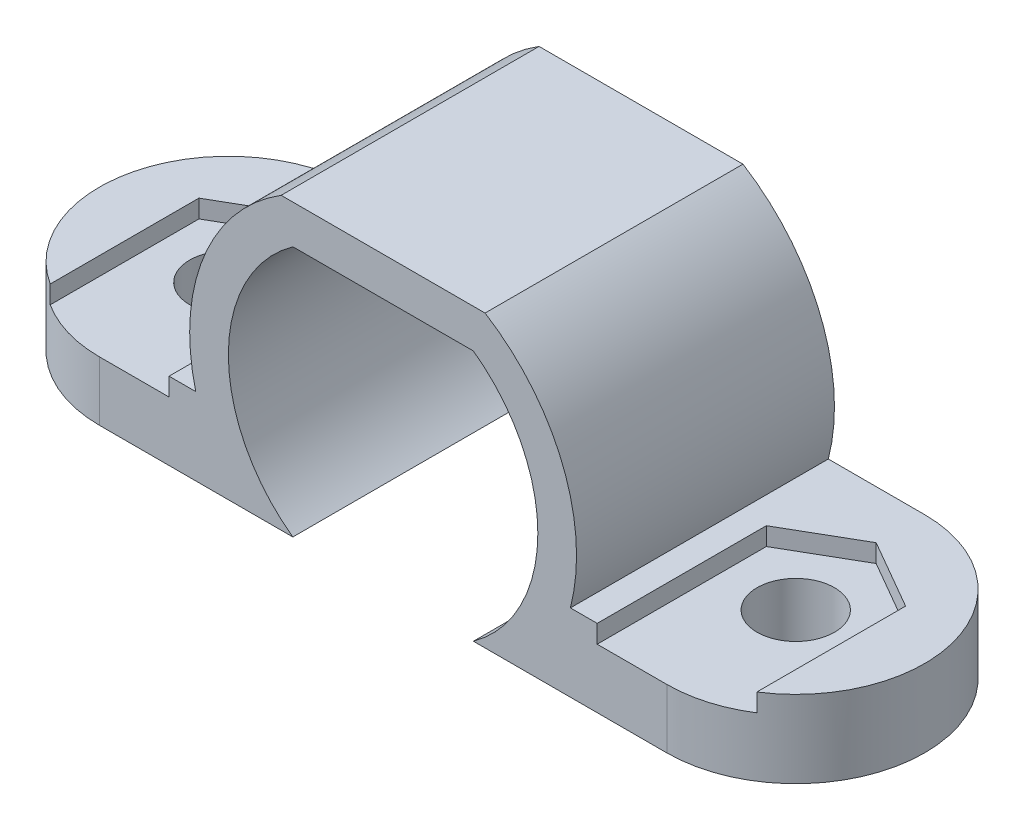
ISO-10303-21;
HEADER;
FILE_DESCRIPTION(('STEP AP214'),'2;1');
FILE_NAME('part.step','',(''),(''),'','','');
FILE_SCHEMA(('AUTOMOTIVE_DESIGN { 1 0 10303 214 1 1 1 1 }'));
ENDSEC;
DATA;
#1=APPLICATION_CONTEXT('core data for automotive mechanical design processes');
#2=APPLICATION_PROTOCOL_DEFINITION('international standard','automotive_design',2000,#1);
#3=PRODUCT_CONTEXT('',#1,'mechanical');
#4=PRODUCT('Part','Part','',(#3));
#5=PRODUCT_RELATED_PRODUCT_CATEGORY('part','',(#4));
#6=PRODUCT_DEFINITION_FORMATION('','',#4);
#7=PRODUCT_DEFINITION_CONTEXT('part definition',#1,'design');
#8=PRODUCT_DEFINITION('design','',#6,#7);
#9=PRODUCT_DEFINITION_SHAPE('','',#8);
#10=(LENGTH_UNIT() NAMED_UNIT(*) SI_UNIT(.MILLI.,.METRE.));
#11=(NAMED_UNIT(*) PLANE_ANGLE_UNIT() SI_UNIT($,.RADIAN.));
#12=(NAMED_UNIT(*) SI_UNIT($,.STERADIAN.) SOLID_ANGLE_UNIT());
#13=UNCERTAINTY_MEASURE_WITH_UNIT(LENGTH_MEASURE(1.E-05),#10,'distance_accuracy_value','');
#14=(GEOMETRIC_REPRESENTATION_CONTEXT(3) GLOBAL_UNCERTAINTY_ASSIGNED_CONTEXT((#13)) GLOBAL_UNIT_ASSIGNED_CONTEXT((#10,
#11,#12)) REPRESENTATION_CONTEXT('',''));
#15=CARTESIAN_POINT('',(0.,0.,0.));
#16=DIRECTION('',(0.,0.,1.));
#17=DIRECTION('',(1.,0.,0.));
#18=AXIS2_PLACEMENT_3D('',#15,#16,#17);
#19=CARTESIAN_POINT('',(7.26225743377546,-1.87339717240448,10.));
#20=DIRECTION('',(0.,-1.,0.));
#21=DIRECTION('',(0.,0.,-1.));
#22=AXIS2_PLACEMENT_3D('',#19,#20,#21);
#23=PLANE('',#22);
#24=DIRECTION('',(-1.,0.,0.));
#25=VECTOR('',#24,1.);
#26=CARTESIAN_POINT('',(7.26225743377546,-1.87339717240448,10.));
#27=LINE('',#26,#25);
#28=CARTESIAN_POINT('',(8.3,-1.87339717240448,10.));
#29=VERTEX_POINT('',#28);
#30=CARTESIAN_POINT('',(7.26225743377546,-1.87339717240448,10.));
#31=VERTEX_POINT('',#30);
#32=EDGE_CURVE('E301',#29,#31,#27,.T.);
#33=ORIENTED_EDGE('',*,*,#32,.F.);
#34=DIRECTION('',(0.,0.,-1.));
#35=VECTOR('',#34,1.);
#36=CARTESIAN_POINT('',(8.3,-1.87339717240448,6.55884572681199));
#37=LINE('',#36,#35);
#38=CARTESIAN_POINT('',(8.3,-1.87339717240448,3.44115427318801));
#39=VERTEX_POINT('',#38);
#40=EDGE_CURVE('E205',#29,#39,#37,.T.);
#41=ORIENTED_EDGE('',*,*,#40,.T.);
#42=DIRECTION('',(0.866025403784438,0.,-0.500000000000001));
#43=VECTOR('',#42,1.);
#44=CARTESIAN_POINT('',(8.3,-1.87339717240448,3.44115427318801));
#45=LINE('',#44,#43);
#46=CARTESIAN_POINT('',(11.,-1.87339717240448,1.88230854637602));
#47=VERTEX_POINT('',#46);
#48=EDGE_CURVE('E229',#39,#47,#45,.T.);
#49=ORIENTED_EDGE('',*,*,#48,.T.);
#50=DIRECTION('',(0.866025403784439,0.,0.499999999999999));
#51=VECTOR('',#50,1.);
#52=CARTESIAN_POINT('',(11.,-1.87339717240448,1.88230854637602));
#53=LINE('',#52,#51);
#54=CARTESIAN_POINT('',(13.7,-1.87339717240448,3.44115427318801));
#55=VERTEX_POINT('',#54);
#56=EDGE_CURVE('E226',#47,#55,#53,.T.);
#57=ORIENTED_EDGE('',*,*,#56,.T.);
#58=DIRECTION('',(0.,0.,1.));
#59=VECTOR('',#58,1.);
#60=CARTESIAN_POINT('',(13.7,-1.87339717240448,3.44115427318801));
#61=LINE('',#60,#59);
#62=CARTESIAN_POINT('',(13.7,-1.87339717240448,9.20832508250017));
#63=VERTEX_POINT('',#62);
#64=EDGE_CURVE('E55',#55,#63,#61,.T.);
#65=ORIENTED_EDGE('',*,*,#64,.T.);
#66=CARTESIAN_POINT('',(11.,-1.87339717240448,5.));
#67=DIRECTION('',(0.,-1.,0.));
#68=DIRECTION('',(0.,0.,-1.));
#69=AXIS2_PLACEMENT_3D('',#66,#67,#68);
#70=CIRCLE('',#69,5.);
#71=CARTESIAN_POINT('',(11.,-1.87339717240448,0.));
#72=VERTEX_POINT('',#71);
#73=EDGE_CURVE('E11',#63,#72,#70,.F.);
#74=ORIENTED_EDGE('',*,*,#73,.T.);
#75=DIRECTION('',(-1.,0.,0.));
#76=VECTOR('',#75,1.);
#77=CARTESIAN_POINT('',(7.26225743377546,-1.87339717240448,0.));
#78=LINE('',#77,#76);
#79=CARTESIAN_POINT('',(7.26225743377546,-1.87339717240448,0.));
#80=VERTEX_POINT('',#79);
#81=EDGE_CURVE('E324',#72,#80,#78,.T.);
#82=ORIENTED_EDGE('',*,*,#81,.T.);
#83=DIRECTION('',(0.,0.,-1.));
#84=VECTOR('',#83,1.);
#85=CARTESIAN_POINT('',(7.26225743377546,-1.87339717240448,10.));
#86=LINE('',#85,#84);
#87=EDGE_CURVE('E334',#31,#80,#86,.T.);
#88=ORIENTED_EDGE('',*,*,#87,.F.);
#89=EDGE_LOOP('',(#33,#41,#49,#57,#65,#74,#82,#88));
#90=FACE_BOUND('',#89,.T.);
#91=ADVANCED_FACE('F37',(#90),#23,.F.);
#92=CARTESIAN_POINT('',(11.,-4.87339717240448,5.));
#93=DIRECTION('',(0.,1.,0.));
#94=DIRECTION('',(0.,0.,1.));
#95=AXIS2_PLACEMENT_3D('',#92,#93,#94);
#96=CYLINDRICAL_SURFACE('',#95,5.);
#97=ORIENTED_EDGE('',*,*,#73,.F.);
#98=DIRECTION('',(0.,1.,0.));
#99=VECTOR('',#98,1.);
#100=CARTESIAN_POINT('',(13.7,-4.87339717240448,9.20832508250017));
#101=LINE('',#100,#99);
#102=CARTESIAN_POINT('',(13.7,-2.57339717240448,9.20832508250017));
#103=VERTEX_POINT('',#102);
#104=EDGE_CURVE('E215',#63,#103,#101,.F.);
#105=ORIENTED_EDGE('',*,*,#104,.T.);
#106=CARTESIAN_POINT('',(11.,-2.57339717240448,5.));
#107=DIRECTION('',(0.,1.,0.));
#108=DIRECTION('',(0.,0.,1.));
#109=AXIS2_PLACEMENT_3D('',#106,#107,#108);
#110=CIRCLE('',#109,5.);
#111=CARTESIAN_POINT('',(11.,-2.57339717240448,10.));
#112=VERTEX_POINT('',#111);
#113=EDGE_CURVE('E213',#103,#112,#110,.F.);
#114=ORIENTED_EDGE('',*,*,#113,.T.);
#115=DIRECTION('',(0.,-1.,0.));
#116=VECTOR('',#115,1.);
#117=CARTESIAN_POINT('',(11.,-4.87339717240448,10.));
#118=LINE('',#117,#116);
#119=CARTESIAN_POINT('',(11.,-4.87339717240448,10.));
#120=VERTEX_POINT('',#119);
#121=EDGE_CURVE('E212',#120,#112,#118,.F.);
#122=ORIENTED_EDGE('',*,*,#121,.F.);
#123=CARTESIAN_POINT('',(11.,-4.87339717240448,5.));
#124=DIRECTION('',(0.,1.,0.));
#125=DIRECTION('',(0.,0.,1.));
#126=AXIS2_PLACEMENT_3D('',#123,#124,#125);
#127=CIRCLE('',#126,5.);
#128=CARTESIAN_POINT('',(11.,-4.87339717240448,0.));
#129=VERTEX_POINT('',#128);
#130=EDGE_CURVE('E47',#129,#120,#127,.F.);
#131=ORIENTED_EDGE('',*,*,#130,.F.);
#132=DIRECTION('',(0.,1.,0.));
#133=VECTOR('',#132,1.);
#134=CARTESIAN_POINT('',(11.,0.,0.));
#135=LINE('',#134,#133);
#136=EDGE_CURVE('E363',#72,#129,#135,.F.);
#137=ORIENTED_EDGE('',*,*,#136,.F.);
#138=EDGE_LOOP('',(#97,#105,#114,#122,#131,#137));
#139=FACE_BOUND('',#138,.T.);
#140=ADVANCED_FACE('F40',(#139),#96,.T.);
#141=CARTESIAN_POINT('',(0.,0.,10.));
#142=DIRECTION('',(0.,0.,1.));
#143=DIRECTION('',(1.,0.,0.));
#144=AXIS2_PLACEMENT_3D('',#141,#142,#143);
#145=PLANE('',#144);
#146=DIRECTION('',(-1.,0.,0.));
#147=VECTOR('',#146,1.);
#148=CARTESIAN_POINT('',(8.3,-2.57339717240448,10.));
#149=LINE('',#148,#147);
#150=CARTESIAN_POINT('',(8.3,-2.57339717240448,10.));
#151=VERTEX_POINT('',#150);
#152=EDGE_CURVE('E193',#112,#151,#149,.T.);
#153=ORIENTED_EDGE('',*,*,#152,.T.);
#154=DIRECTION('',(0.,1.,0.));
#155=VECTOR('',#154,1.);
#156=CARTESIAN_POINT('',(8.3,-1.87339717240448,10.));
#157=LINE('',#156,#155);
#158=EDGE_CURVE('E203',#151,#29,#157,.T.);
#159=ORIENTED_EDGE('',*,*,#158,.T.);
#160=ORIENTED_EDGE('',*,*,#32,.T.);
#161=CARTESIAN_POINT('',(0.,0.,10.));
#162=DIRECTION('',(0.,0.,1.));
#163=DIRECTION('',(1.,0.,0.));
#164=AXIS2_PLACEMENT_3D('',#161,#162,#163);
#165=CIRCLE('',#164,7.5);
#166=CARTESIAN_POINT('',(3.95345525873084,6.37339717240448,10.));
#167=VERTEX_POINT('',#166);
#168=EDGE_CURVE('E303',#31,#167,#165,.T.);
#169=ORIENTED_EDGE('',*,*,#168,.T.);
#170=DIRECTION('',(-1.,0.,0.));
#171=VECTOR('',#170,1.);
#172=CARTESIAN_POINT('',(-3.95345525873084,6.37339717240448,10.));
#173=LINE('',#172,#171);
#174=CARTESIAN_POINT('',(-3.95345525873084,6.37339717240448,10.));
#175=VERTEX_POINT('',#174);
#176=EDGE_CURVE('E305',#167,#175,#173,.T.);
#177=ORIENTED_EDGE('',*,*,#176,.T.);
#178=CARTESIAN_POINT('',(0.,0.,10.));
#179=DIRECTION('',(0.,0.,1.));
#180=DIRECTION('',(1.,0.,0.));
#181=AXIS2_PLACEMENT_3D('',#178,#179,#180);
#182=CIRCLE('',#181,7.5);
#183=CARTESIAN_POINT('',(-7.26225743377546,-1.87339717240448,10.));
#184=VERTEX_POINT('',#183);
#185=EDGE_CURVE('E284',#175,#184,#182,.T.);
#186=ORIENTED_EDGE('',*,*,#185,.T.);
#187=DIRECTION('',(-1.,0.,0.));
#188=VECTOR('',#187,1.);
#189=CARTESIAN_POINT('',(-16.,-1.87339717240448,10.));
#190=LINE('',#189,#188);
#191=CARTESIAN_POINT('',(-8.3,-1.87339717240448,10.));
#192=VERTEX_POINT('',#191);
#193=EDGE_CURVE('E287',#184,#192,#190,.T.);
#194=ORIENTED_EDGE('',*,*,#193,.T.);
#195=DIRECTION('',(0.,1.,0.));
#196=VECTOR('',#195,1.);
#197=CARTESIAN_POINT('',(-8.3,-1.87339717240448,10.));
#198=LINE('',#197,#196);
#199=CARTESIAN_POINT('',(-8.3,-2.57339717240448,10.));
#200=VERTEX_POINT('',#199);
#201=EDGE_CURVE('E238',#200,#192,#198,.T.);
#202=ORIENTED_EDGE('',*,*,#201,.F.);
#203=DIRECTION('',(1.,0.,0.));
#204=VECTOR('',#203,1.);
#205=CARTESIAN_POINT('',(-8.3,-2.57339717240448,10.));
#206=LINE('',#205,#204);
#207=CARTESIAN_POINT('',(-11.,-2.57339717240448,10.));
#208=VERTEX_POINT('',#207);
#209=EDGE_CURVE('E241',#208,#200,#206,.T.);
#210=ORIENTED_EDGE('',*,*,#209,.F.);
#211=DIRECTION('',(0.,1.,0.));
#212=VECTOR('',#211,1.);
#213=CARTESIAN_POINT('',(-11.,-1.87339717240448,10.));
#214=LINE('',#213,#212);
#215=CARTESIAN_POINT('',(-11.,-4.87339717240448,10.));
#216=VERTEX_POINT('',#215);
#217=EDGE_CURVE('E352',#208,#216,#214,.F.);
#218=ORIENTED_EDGE('',*,*,#217,.T.);
#219=DIRECTION('',(1.,0.,0.));
#220=VECTOR('',#219,1.);
#221=CARTESIAN_POINT('',(-16.,-4.87339717240448,10.));
#222=LINE('',#221,#220);
#223=CARTESIAN_POINT('',(-3.5,-4.87339717240448,10.));
#224=VERTEX_POINT('',#223);
#225=EDGE_CURVE('E291',#216,#224,#222,.T.);
#226=ORIENTED_EDGE('',*,*,#225,.T.);
#227=CARTESIAN_POINT('',(0.,0.,10.));
#228=DIRECTION('',(0.,0.,-1.));
#229=DIRECTION('',(1.,0.,0.));
#230=AXIS2_PLACEMENT_3D('',#227,#228,#229);
#231=CIRCLE('',#230,6.);
#232=CARTESIAN_POINT('',(-3.5,4.87339717240448,10.));
#233=VERTEX_POINT('',#232);
#234=EDGE_CURVE('E293',#224,#233,#231,.T.);
#235=ORIENTED_EDGE('',*,*,#234,.T.);
#236=DIRECTION('',(1.,0.,0.));
#237=VECTOR('',#236,1.);
#238=CARTESIAN_POINT('',(-3.5,4.87339717240448,10.));
#239=LINE('',#238,#237);
#240=CARTESIAN_POINT('',(3.5,4.87339717240448,10.));
#241=VERTEX_POINT('',#240);
#242=EDGE_CURVE('E295',#233,#241,#239,.T.);
#243=ORIENTED_EDGE('',*,*,#242,.T.);
#244=CARTESIAN_POINT('',(0.,0.,10.));
#245=DIRECTION('',(0.,0.,-1.));
#246=DIRECTION('',(1.,0.,0.));
#247=AXIS2_PLACEMENT_3D('',#244,#245,#246);
#248=CIRCLE('',#247,6.);
#249=CARTESIAN_POINT('',(3.5,-4.87339717240448,10.));
#250=VERTEX_POINT('',#249);
#251=EDGE_CURVE('E297',#241,#250,#248,.T.);
#252=ORIENTED_EDGE('',*,*,#251,.T.);
#253=DIRECTION('',(1.,0.,0.));
#254=VECTOR('',#253,1.);
#255=CARTESIAN_POINT('',(3.5,-4.87339717240448,10.));
#256=LINE('',#255,#254);
#257=EDGE_CURVE('E299',#250,#120,#256,.T.);
#258=ORIENTED_EDGE('',*,*,#257,.T.);
#259=ORIENTED_EDGE('',*,*,#121,.T.);
#260=EDGE_LOOP('',(#153,#159,#160,#169,#177,#186,#194,#202,#210,#218,#226,#235,#243,#252,#258,#259));
#261=FACE_BOUND('',#260,.T.);
#262=ADVANCED_FACE('F210',(#261),#145,.T.);
#263=CARTESIAN_POINT('',(11.,-4.87339717240448,5.));
#264=DIRECTION('',(0.,1.,0.));
#265=DIRECTION('',(0.,0.,1.));
#266=AXIS2_PLACEMENT_3D('',#263,#264,#265);
#267=CYLINDRICAL_SURFACE('',#266,1.5);
#268=CARTESIAN_POINT('',(11.,-4.87339717240448,5.));
#269=DIRECTION('',(0.,1.,0.));
#270=DIRECTION('',(0.,0.,1.));
#271=AXIS2_PLACEMENT_3D('',#268,#269,#270);
#272=CIRCLE('',#271,1.5);
#273=CARTESIAN_POINT('',(11.,-4.87339717240448,6.5));
#274=VERTEX_POINT('',#273);
#275=EDGE_CURVE('E277',#274,#274,#272,.T.);
#276=ORIENTED_EDGE('',*,*,#275,.F.);
#277=EDGE_LOOP('',(#276));
#278=FACE_BOUND('',#277,.T.);
#279=CARTESIAN_POINT('',(11.,-2.57339717240448,5.));
#280=DIRECTION('',(0.,1.,0.));
#281=DIRECTION('',(0.,0.,1.));
#282=AXIS2_PLACEMENT_3D('',#279,#280,#281);
#283=CIRCLE('',#282,1.5);
#284=CARTESIAN_POINT('',(11.,-2.57339717240448,6.5));
#285=VERTEX_POINT('',#284);
#286=EDGE_CURVE('E42',#285,#285,#283,.F.);
#287=ORIENTED_EDGE('',*,*,#286,.F.);
#288=EDGE_LOOP('',(#287));
#289=FACE_BOUND('',#288,.T.);
#290=ADVANCED_FACE('F374',(#278,#289),#267,.F.);
#291=CARTESIAN_POINT('',(-11.,-4.87339717240448,5.));
#292=DIRECTION('',(0.,1.,0.));
#293=DIRECTION('',(0.,0.,1.));
#294=AXIS2_PLACEMENT_3D('',#291,#292,#293);
#295=CYLINDRICAL_SURFACE('',#294,1.5);
#296=CARTESIAN_POINT('',(-11.,-4.87339717240448,5.));
#297=DIRECTION('',(0.,1.,0.));
#298=DIRECTION('',(0.,0.,1.));
#299=AXIS2_PLACEMENT_3D('',#296,#297,#298);
#300=CIRCLE('',#299,1.5);
#301=CARTESIAN_POINT('',(-11.,-4.87339717240448,6.5));
#302=VERTEX_POINT('',#301);
#303=EDGE_CURVE('E280',#302,#302,#300,.T.);
#304=ORIENTED_EDGE('',*,*,#303,.F.);
#305=EDGE_LOOP('',(#304));
#306=FACE_BOUND('',#305,.T.);
#307=CARTESIAN_POINT('',(-11.,-2.57339717240448,5.));
#308=DIRECTION('',(0.,1.,0.));
#309=DIRECTION('',(0.,0.,1.));
#310=AXIS2_PLACEMENT_3D('',#307,#308,#309);
#311=CIRCLE('',#310,1.5);
#312=CARTESIAN_POINT('',(-11.,-2.57339717240448,6.5));
#313=VERTEX_POINT('',#312);
#314=EDGE_CURVE('E272',#313,#313,#311,.F.);
#315=ORIENTED_EDGE('',*,*,#314,.F.);
#316=EDGE_LOOP('',(#315));
#317=FACE_BOUND('',#316,.T.);
#318=ADVANCED_FACE('F371',(#306,#317),#295,.F.);
#319=CARTESIAN_POINT('',(-11.,-1.87339717240448,5.));
#320=DIRECTION('',(0.,-1.,0.));
#321=DIRECTION('',(0.,0.,-1.));
#322=AXIS2_PLACEMENT_3D('',#319,#320,#321);
#323=CYLINDRICAL_SURFACE('',#322,5.);
#324=CARTESIAN_POINT('',(-11.,-2.57339717240448,5.));
#325=DIRECTION('',(0.,-1.,0.));
#326=DIRECTION('',(0.,0.,-1.));
#327=AXIS2_PLACEMENT_3D('',#324,#325,#326);
#328=CIRCLE('',#327,5.);
#329=CARTESIAN_POINT('',(-13.7,-2.57339717240448,9.20832508250017));
#330=VERTEX_POINT('',#329);
#331=EDGE_CURVE('E247',#330,#208,#328,.F.);
#332=ORIENTED_EDGE('',*,*,#331,.F.);
#333=DIRECTION('',(0.,-1.,0.));
#334=VECTOR('',#333,1.);
#335=CARTESIAN_POINT('',(-13.7,-1.87339717240448,9.20832508250017));
#336=LINE('',#335,#334);
#337=CARTESIAN_POINT('',(-13.7,-1.87339717240448,9.20832508250017));
#338=VERTEX_POINT('',#337);
#339=EDGE_CURVE('E244',#338,#330,#336,.T.);
#340=ORIENTED_EDGE('',*,*,#339,.F.);
#341=CARTESIAN_POINT('',(-11.,-1.87339717240448,5.));
#342=DIRECTION('',(0.,-1.,0.));
#343=DIRECTION('',(0.,0.,-1.));
#344=AXIS2_PLACEMENT_3D('',#341,#342,#343);
#345=CIRCLE('',#344,5.);
#346=CARTESIAN_POINT('',(-11.,-1.87339717240448,0.));
#347=VERTEX_POINT('',#346);
#348=EDGE_CURVE('E357',#347,#338,#345,.F.);
#349=ORIENTED_EDGE('',*,*,#348,.F.);
#350=DIRECTION('',(0.,-1.,0.));
#351=VECTOR('',#350,1.);
#352=CARTESIAN_POINT('',(-11.,0.,0.));
#353=LINE('',#352,#351);
#354=CARTESIAN_POINT('',(-11.,-4.87339717240448,0.));
#355=VERTEX_POINT('',#354);
#356=EDGE_CURVE('E354',#355,#347,#353,.F.);
#357=ORIENTED_EDGE('',*,*,#356,.F.);
#358=CARTESIAN_POINT('',(-11.,-4.87339717240448,5.));
#359=DIRECTION('',(0.,1.,0.));
#360=DIRECTION('',(0.,0.,1.));
#361=AXIS2_PLACEMENT_3D('',#358,#359,#360);
#362=CIRCLE('',#361,5.);
#363=EDGE_CURVE('E360',#216,#355,#362,.F.);
#364=ORIENTED_EDGE('',*,*,#363,.F.);
#365=ORIENTED_EDGE('',*,*,#217,.F.);
#366=EDGE_LOOP('',(#332,#340,#349,#357,#364,#365));
#367=FACE_BOUND('',#366,.T.);
#368=ADVANCED_FACE('F373',(#367),#323,.T.);
#369=CARTESIAN_POINT('',(0.,0.,10.));
#370=DIRECTION('',(0.,0.,-1.));
#371=DIRECTION('',(-1.,0.,0.));
#372=AXIS2_PLACEMENT_3D('',#369,#370,#371);
#373=CYLINDRICAL_SURFACE('',#372,7.5);
#374=CARTESIAN_POINT('',(0.,0.,0.));
#375=DIRECTION('',(0.,0.,1.));
#376=DIRECTION('',(1.,0.,0.));
#377=AXIS2_PLACEMENT_3D('',#374,#375,#376);
#378=CIRCLE('',#377,7.5);
#379=CARTESIAN_POINT('',(-3.95345525873084,6.37339717240448,0.));
#380=VERTEX_POINT('',#379);
#381=CARTESIAN_POINT('',(-7.26225743377546,-1.87339717240448,0.));
#382=VERTEX_POINT('',#381);
#383=EDGE_CURVE('E283',#380,#382,#378,.T.);
#384=ORIENTED_EDGE('',*,*,#383,.T.);
#385=DIRECTION('',(0.,0.,-1.));
#386=VECTOR('',#385,1.);
#387=CARTESIAN_POINT('',(-7.26225743377546,-1.87339717240448,10.));
#388=LINE('',#387,#386);
#389=EDGE_CURVE('E349',#184,#382,#388,.T.);
#390=ORIENTED_EDGE('',*,*,#389,.F.);
#391=ORIENTED_EDGE('',*,*,#185,.F.);
#392=DIRECTION('',(0.,0.,-1.));
#393=VECTOR('',#392,1.);
#394=CARTESIAN_POINT('',(-3.95345525873084,6.37339717240448,10.));
#395=LINE('',#394,#393);
#396=EDGE_CURVE('E307',#175,#380,#395,.T.);
#397=ORIENTED_EDGE('',*,*,#396,.T.);
#398=EDGE_LOOP('',(#384,#390,#391,#397));
#399=FACE_BOUND('',#398,.T.);
#400=ADVANCED_FACE('F381',(#399),#373,.T.);
#401=CARTESIAN_POINT('',(-16.,-1.87339717240448,10.));
#402=DIRECTION('',(0.,-1.,0.));
#403=DIRECTION('',(0.,0.,-1.));
#404=AXIS2_PLACEMENT_3D('',#401,#402,#403);
#405=PLANE('',#404);
#406=DIRECTION('',(0.,0.,-1.));
#407=VECTOR('',#406,1.);
#408=CARTESIAN_POINT('',(-8.3,-1.87339717240448,6.55884572681199));
#409=LINE('',#408,#407);
#410=CARTESIAN_POINT('',(-8.3,-1.87339717240448,3.44115427318801));
#411=VERTEX_POINT('',#410);
#412=EDGE_CURVE('E263',#192,#411,#409,.T.);
#413=ORIENTED_EDGE('',*,*,#412,.F.);
#414=ORIENTED_EDGE('',*,*,#193,.F.);
#415=ORIENTED_EDGE('',*,*,#389,.T.);
#416=DIRECTION('',(-1.,0.,0.));
#417=VECTOR('',#416,1.);
#418=CARTESIAN_POINT('',(-16.,-1.87339717240448,0.));
#419=LINE('',#418,#417);
#420=EDGE_CURVE('E310',#382,#347,#419,.T.);
#421=ORIENTED_EDGE('',*,*,#420,.T.);
#422=ORIENTED_EDGE('',*,*,#348,.T.);
#423=DIRECTION('',(0.,0.,1.));
#424=VECTOR('',#423,1.);
#425=CARTESIAN_POINT('',(-13.7,-1.87339717240448,3.44115427318801));
#426=LINE('',#425,#424);
#427=CARTESIAN_POINT('',(-13.7,-1.87339717240448,3.44115427318801));
#428=VERTEX_POINT('',#427);
#429=EDGE_CURVE('E249',#428,#338,#426,.T.);
#430=ORIENTED_EDGE('',*,*,#429,.F.);
#431=DIRECTION('',(-0.866025403784439,0.,0.499999999999999));
#432=VECTOR('',#431,1.);
#433=CARTESIAN_POINT('',(-11.,-1.87339717240448,1.88230854637602));
#434=LINE('',#433,#432);
#435=CARTESIAN_POINT('',(-11.,-1.87339717240448,1.88230854637602));
#436=VERTEX_POINT('',#435);
#437=EDGE_CURVE('E253',#436,#428,#434,.T.);
#438=ORIENTED_EDGE('',*,*,#437,.F.);
#439=DIRECTION('',(-0.866025403784438,0.,-0.500000000000001));
#440=VECTOR('',#439,1.);
#441=CARTESIAN_POINT('',(-8.3,-1.87339717240448,3.44115427318801));
#442=LINE('',#441,#440);
#443=EDGE_CURVE('E265',#411,#436,#442,.T.);
#444=ORIENTED_EDGE('',*,*,#443,.F.);
#445=EDGE_LOOP('',(#413,#414,#415,#421,#422,#430,#438,#444));
#446=FACE_BOUND('',#445,.T.);
#447=ADVANCED_FACE('F416',(#446),#405,.F.);
#448=CARTESIAN_POINT('',(-16.,-4.87339717240448,10.));
#449=DIRECTION('',(0.,1.,0.));
#450=DIRECTION('',(0.,0.,1.));
#451=AXIS2_PLACEMENT_3D('',#448,#449,#450);
#452=PLANE('',#451);
#453=ORIENTED_EDGE('',*,*,#303,.T.);
#454=EDGE_LOOP('',(#453));
#455=FACE_BOUND('',#454,.T.);
#456=ORIENTED_EDGE('',*,*,#225,.F.);
#457=ORIENTED_EDGE('',*,*,#363,.T.);
#458=DIRECTION('',(1.,0.,0.));
#459=VECTOR('',#458,1.);
#460=CARTESIAN_POINT('',(-16.,-4.87339717240448,0.));
#461=LINE('',#460,#459);
#462=CARTESIAN_POINT('',(-3.5,-4.87339717240448,0.));
#463=VERTEX_POINT('',#462);
#464=EDGE_CURVE('E313',#355,#463,#461,.T.);
#465=ORIENTED_EDGE('',*,*,#464,.T.);
#466=DIRECTION('',(0.,0.,-1.));
#467=VECTOR('',#466,1.);
#468=CARTESIAN_POINT('',(-3.5,-4.87339717240448,10.));
#469=LINE('',#468,#467);
#470=EDGE_CURVE('E346',#224,#463,#469,.T.);
#471=ORIENTED_EDGE('',*,*,#470,.F.);
#472=EDGE_LOOP('',(#456,#457,#465,#471));
#473=FACE_BOUND('',#472,.T.);
#474=ADVANCED_FACE('F412',(#455,#473),#452,.F.);
#475=CARTESIAN_POINT('',(0.,0.,10.));
#476=DIRECTION('',(0.,0.,-1.));
#477=DIRECTION('',(-1.,0.,0.));
#478=AXIS2_PLACEMENT_3D('',#475,#476,#477);
#479=CYLINDRICAL_SURFACE('',#478,6.);
#480=CARTESIAN_POINT('',(0.,0.,0.));
#481=DIRECTION('',(0.,0.,-1.));
#482=DIRECTION('',(1.,0.,0.));
#483=AXIS2_PLACEMENT_3D('',#480,#481,#482);
#484=CIRCLE('',#483,6.);
#485=CARTESIAN_POINT('',(-3.5,4.87339717240448,0.));
#486=VERTEX_POINT('',#485);
#487=EDGE_CURVE('E315',#463,#486,#484,.T.);
#488=ORIENTED_EDGE('',*,*,#487,.T.);
#489=DIRECTION('',(0.,0.,-1.));
#490=VECTOR('',#489,1.);
#491=CARTESIAN_POINT('',(-3.5,4.87339717240448,10.));
#492=LINE('',#491,#490);
#493=EDGE_CURVE('E343',#233,#486,#492,.T.);
#494=ORIENTED_EDGE('',*,*,#493,.F.);
#495=ORIENTED_EDGE('',*,*,#234,.F.);
#496=ORIENTED_EDGE('',*,*,#470,.T.);
#497=EDGE_LOOP('',(#488,#494,#495,#496));
#498=FACE_BOUND('',#497,.T.);
#499=ADVANCED_FACE('F408',(#498),#479,.F.);
#500=CARTESIAN_POINT('',(-3.5,4.87339717240448,10.));
#501=DIRECTION('',(0.,1.,0.));
#502=DIRECTION('',(0.,0.,1.));
#503=AXIS2_PLACEMENT_3D('',#500,#501,#502);
#504=PLANE('',#503);
#505=DIRECTION('',(1.,0.,0.));
#506=VECTOR('',#505,1.);
#507=CARTESIAN_POINT('',(-3.5,4.87339717240448,0.));
#508=LINE('',#507,#506);
#509=CARTESIAN_POINT('',(3.5,4.87339717240448,0.));
#510=VERTEX_POINT('',#509);
#511=EDGE_CURVE('E317',#486,#510,#508,.T.);
#512=ORIENTED_EDGE('',*,*,#511,.T.);
#513=DIRECTION('',(0.,0.,-1.));
#514=VECTOR('',#513,1.);
#515=CARTESIAN_POINT('',(3.5,4.87339717240448,10.));
#516=LINE('',#515,#514);
#517=EDGE_CURVE('E340',#241,#510,#516,.T.);
#518=ORIENTED_EDGE('',*,*,#517,.F.);
#519=ORIENTED_EDGE('',*,*,#242,.F.);
#520=ORIENTED_EDGE('',*,*,#493,.T.);
#521=EDGE_LOOP('',(#512,#518,#519,#520));
#522=FACE_BOUND('',#521,.T.);
#523=ADVANCED_FACE('F404',(#522),#504,.F.);
#524=CARTESIAN_POINT('',(0.,0.,10.));
#525=DIRECTION('',(0.,0.,-1.));
#526=DIRECTION('',(-1.,0.,0.));
#527=AXIS2_PLACEMENT_3D('',#524,#525,#526);
#528=CYLINDRICAL_SURFACE('',#527,6.);
#529=CARTESIAN_POINT('',(0.,0.,0.));
#530=DIRECTION('',(0.,0.,-1.));
#531=DIRECTION('',(1.,0.,0.));
#532=AXIS2_PLACEMENT_3D('',#529,#530,#531);
#533=CIRCLE('',#532,6.);
#534=CARTESIAN_POINT('',(3.5,-4.87339717240448,0.));
#535=VERTEX_POINT('',#534);
#536=EDGE_CURVE('E319',#510,#535,#533,.T.);
#537=ORIENTED_EDGE('',*,*,#536,.T.);
#538=DIRECTION('',(0.,0.,-1.));
#539=VECTOR('',#538,1.);
#540=CARTESIAN_POINT('',(3.5,-4.87339717240448,10.));
#541=LINE('',#540,#539);
#542=EDGE_CURVE('E337',#250,#535,#541,.T.);
#543=ORIENTED_EDGE('',*,*,#542,.F.);
#544=ORIENTED_EDGE('',*,*,#251,.F.);
#545=ORIENTED_EDGE('',*,*,#517,.T.);
#546=EDGE_LOOP('',(#537,#543,#544,#545));
#547=FACE_BOUND('',#546,.T.);
#548=ADVANCED_FACE('F400',(#547),#528,.F.);
#549=CARTESIAN_POINT('',(3.5,-4.87339717240448,10.));
#550=DIRECTION('',(0.,1.,0.));
#551=DIRECTION('',(0.,0.,1.));
#552=AXIS2_PLACEMENT_3D('',#549,#550,#551);
#553=PLANE('',#552);
#554=ORIENTED_EDGE('',*,*,#275,.T.);
#555=EDGE_LOOP('',(#554));
#556=FACE_BOUND('',#555,.T.);
#557=DIRECTION('',(1.,0.,0.));
#558=VECTOR('',#557,1.);
#559=CARTESIAN_POINT('',(3.5,-4.87339717240448,0.));
#560=LINE('',#559,#558);
#561=EDGE_CURVE('E321',#535,#129,#560,.T.);
#562=ORIENTED_EDGE('',*,*,#561,.T.);
#563=ORIENTED_EDGE('',*,*,#130,.T.);
#564=ORIENTED_EDGE('',*,*,#257,.F.);
#565=ORIENTED_EDGE('',*,*,#542,.T.);
#566=EDGE_LOOP('',(#562,#563,#564,#565));
#567=FACE_BOUND('',#566,.T.);
#568=ADVANCED_FACE('F397',(#556,#567),#553,.F.);
#569=CARTESIAN_POINT('',(0.,0.,10.));
#570=DIRECTION('',(0.,0.,-1.));
#571=DIRECTION('',(-1.,0.,0.));
#572=AXIS2_PLACEMENT_3D('',#569,#570,#571);
#573=CYLINDRICAL_SURFACE('',#572,7.5);
#574=CARTESIAN_POINT('',(0.,0.,0.));
#575=DIRECTION('',(0.,0.,1.));
#576=DIRECTION('',(1.,0.,0.));
#577=AXIS2_PLACEMENT_3D('',#574,#575,#576);
#578=CIRCLE('',#577,7.5);
#579=CARTESIAN_POINT('',(3.95345525873084,6.37339717240448,0.));
#580=VERTEX_POINT('',#579);
#581=EDGE_CURVE('E326',#80,#580,#578,.T.);
#582=ORIENTED_EDGE('',*,*,#581,.T.);
#583=DIRECTION('',(0.,0.,-1.));
#584=VECTOR('',#583,1.);
#585=CARTESIAN_POINT('',(3.95345525873084,6.37339717240448,10.));
#586=LINE('',#585,#584);
#587=EDGE_CURVE('E331',#167,#580,#586,.T.);
#588=ORIENTED_EDGE('',*,*,#587,.F.);
#589=ORIENTED_EDGE('',*,*,#168,.F.);
#590=ORIENTED_EDGE('',*,*,#87,.T.);
#591=EDGE_LOOP('',(#582,#588,#589,#590));
#592=FACE_BOUND('',#591,.T.);
#593=ADVANCED_FACE('F395',(#592),#573,.T.);
#594=CARTESIAN_POINT('',(-3.95345525873084,6.37339717240448,10.));
#595=DIRECTION('',(0.,-1.,0.));
#596=DIRECTION('',(0.,0.,-1.));
#597=AXIS2_PLACEMENT_3D('',#594,#595,#596);
#598=PLANE('',#597);
#599=DIRECTION('',(-1.,0.,0.));
#600=VECTOR('',#599,1.);
#601=CARTESIAN_POINT('',(-3.95345525873084,6.37339717240448,0.));
#602=LINE('',#601,#600);
#603=EDGE_CURVE('E288',#580,#380,#602,.T.);
#604=ORIENTED_EDGE('',*,*,#603,.T.);
#605=ORIENTED_EDGE('',*,*,#396,.F.);
#606=ORIENTED_EDGE('',*,*,#176,.F.);
#607=ORIENTED_EDGE('',*,*,#587,.T.);
#608=EDGE_LOOP('',(#604,#605,#606,#607));
#609=FACE_BOUND('',#608,.T.);
#610=ADVANCED_FACE('F447',(#609),#598,.F.);
#611=CARTESIAN_POINT('',(0.,0.,0.));
#612=DIRECTION('',(0.,0.,1.));
#613=DIRECTION('',(1.,0.,0.));
#614=AXIS2_PLACEMENT_3D('',#611,#612,#613);
#615=PLANE('',#614);
#616=ORIENTED_EDGE('',*,*,#81,.F.);
#617=ORIENTED_EDGE('',*,*,#136,.T.);
#618=ORIENTED_EDGE('',*,*,#561,.F.);
#619=ORIENTED_EDGE('',*,*,#536,.F.);
#620=ORIENTED_EDGE('',*,*,#511,.F.);
#621=ORIENTED_EDGE('',*,*,#487,.F.);
#622=ORIENTED_EDGE('',*,*,#464,.F.);
#623=ORIENTED_EDGE('',*,*,#356,.T.);
#624=ORIENTED_EDGE('',*,*,#420,.F.);
#625=ORIENTED_EDGE('',*,*,#383,.F.);
#626=ORIENTED_EDGE('',*,*,#603,.F.);
#627=ORIENTED_EDGE('',*,*,#581,.F.);
#628=EDGE_LOOP('',(#616,#617,#618,#619,#620,#621,#622,#623,#624,#625,#626,#627));
#629=FACE_BOUND('',#628,.T.);
#630=ADVANCED_FACE('F437',(#629),#615,.F.);
#631=CARTESIAN_POINT('',(0.,-2.57339717240448,0.));
#632=DIRECTION('',(0.,1.,0.));
#633=DIRECTION('',(0.,0.,1.));
#634=AXIS2_PLACEMENT_3D('',#631,#632,#633);
#635=PLANE('',#634);
#636=ORIENTED_EDGE('',*,*,#314,.T.);
#637=EDGE_LOOP('',(#636));
#638=FACE_BOUND('',#637,.T.);
#639=DIRECTION('',(0.,0.,-1.));
#640=VECTOR('',#639,1.);
#641=CARTESIAN_POINT('',(-8.3,-2.57339717240448,6.55884572681199));
#642=LINE('',#641,#640);
#643=CARTESIAN_POINT('',(-8.3,-2.57339717240448,3.44115427318801));
#644=VERTEX_POINT('',#643);
#645=EDGE_CURVE('E252',#200,#644,#642,.T.);
#646=ORIENTED_EDGE('',*,*,#645,.T.);
#647=DIRECTION('',(-0.866025403784438,0.,-0.500000000000001));
#648=VECTOR('',#647,1.);
#649=CARTESIAN_POINT('',(-8.3,-2.57339717240448,3.44115427318801));
#650=LINE('',#649,#648);
#651=CARTESIAN_POINT('',(-11.,-2.57339717240448,1.88230854637602));
#652=VERTEX_POINT('',#651);
#653=EDGE_CURVE('E255',#644,#652,#650,.T.);
#654=ORIENTED_EDGE('',*,*,#653,.T.);
#655=DIRECTION('',(-0.866025403784439,0.,0.499999999999999));
#656=VECTOR('',#655,1.);
#657=CARTESIAN_POINT('',(-11.,-2.57339717240448,1.88230854637602));
#658=LINE('',#657,#656);
#659=CARTESIAN_POINT('',(-13.7,-2.57339717240448,3.44115427318801));
#660=VERTEX_POINT('',#659);
#661=EDGE_CURVE('E258',#652,#660,#658,.T.);
#662=ORIENTED_EDGE('',*,*,#661,.T.);
#663=DIRECTION('',(0.,0.,1.));
#664=VECTOR('',#663,1.);
#665=CARTESIAN_POINT('',(-13.7,-2.57339717240448,3.44115427318801));
#666=LINE('',#665,#664);
#667=EDGE_CURVE('E250',#660,#330,#666,.T.);
#668=ORIENTED_EDGE('',*,*,#667,.T.);
#669=ORIENTED_EDGE('',*,*,#331,.T.);
#670=ORIENTED_EDGE('',*,*,#209,.T.);
#671=EDGE_LOOP('',(#646,#654,#662,#668,#669,#670));
#672=FACE_BOUND('',#671,.T.);
#673=ADVANCED_FACE('F368',(#638,#672),#635,.T.);
#674=CARTESIAN_POINT('',(-13.7,-2.57339717240448,3.44115427318801));
#675=DIRECTION('',(-1.,0.,0.));
#676=DIRECTION('',(0.,0.,1.));
#677=AXIS2_PLACEMENT_3D('',#674,#675,#676);
#678=PLANE('',#677);
#679=ORIENTED_EDGE('',*,*,#429,.T.);
#680=ORIENTED_EDGE('',*,*,#339,.T.);
#681=ORIENTED_EDGE('',*,*,#667,.F.);
#682=DIRECTION('',(0.,1.,0.));
#683=VECTOR('',#682,1.);
#684=CARTESIAN_POINT('',(-13.7,-2.57339717240448,3.44115427318801));
#685=LINE('',#684,#683);
#686=EDGE_CURVE('E270',#660,#428,#685,.T.);
#687=ORIENTED_EDGE('',*,*,#686,.T.);
#688=EDGE_LOOP('',(#679,#680,#681,#687));
#689=FACE_BOUND('',#688,.T.);
#690=ADVANCED_FACE('F475',(#689),#678,.F.);
#691=CARTESIAN_POINT('',(-11.,-2.57339717240448,1.88230854637602));
#692=DIRECTION('',(-0.499999999999999,0.,-0.866025403784439));
#693=DIRECTION('',(-0.866025403784439,0.,0.499999999999999));
#694=AXIS2_PLACEMENT_3D('',#691,#692,#693);
#695=PLANE('',#694);
#696=ORIENTED_EDGE('',*,*,#437,.T.);
#697=ORIENTED_EDGE('',*,*,#686,.F.);
#698=ORIENTED_EDGE('',*,*,#661,.F.);
#699=DIRECTION('',(0.,1.,0.));
#700=VECTOR('',#699,1.);
#701=CARTESIAN_POINT('',(-11.,-2.57339717240448,1.88230854637602));
#702=LINE('',#701,#700);
#703=EDGE_CURVE('E273',#652,#436,#702,.T.);
#704=ORIENTED_EDGE('',*,*,#703,.T.);
#705=EDGE_LOOP('',(#696,#697,#698,#704));
#706=FACE_BOUND('',#705,.T.);
#707=ADVANCED_FACE('F476',(#706),#695,.F.);
#708=CARTESIAN_POINT('',(-8.3,-2.57339717240448,3.44115427318801));
#709=DIRECTION('',(0.500000000000001,0.,-0.866025403784438));
#710=DIRECTION('',(-0.866025403784438,0.,-0.500000000000001));
#711=AXIS2_PLACEMENT_3D('',#708,#709,#710);
#712=PLANE('',#711);
#713=ORIENTED_EDGE('',*,*,#443,.T.);
#714=ORIENTED_EDGE('',*,*,#703,.F.);
#715=ORIENTED_EDGE('',*,*,#653,.F.);
#716=DIRECTION('',(0.,1.,0.));
#717=VECTOR('',#716,1.);
#718=CARTESIAN_POINT('',(-8.3,-2.57339717240448,3.44115427318801));
#719=LINE('',#718,#717);
#720=EDGE_CURVE('E261',#644,#411,#719,.T.);
#721=ORIENTED_EDGE('',*,*,#720,.T.);
#722=EDGE_LOOP('',(#713,#714,#715,#721));
#723=FACE_BOUND('',#722,.T.);
#724=ADVANCED_FACE('F479',(#723),#712,.F.);
#725=CARTESIAN_POINT('',(-8.3,-2.57339717240448,6.55884572681199));
#726=DIRECTION('',(1.,0.,0.));
#727=DIRECTION('',(0.,0.,-1.));
#728=AXIS2_PLACEMENT_3D('',#725,#726,#727);
#729=PLANE('',#728);
#730=ORIENTED_EDGE('',*,*,#720,.F.);
#731=ORIENTED_EDGE('',*,*,#645,.F.);
#732=ORIENTED_EDGE('',*,*,#201,.T.);
#733=ORIENTED_EDGE('',*,*,#412,.T.);
#734=EDGE_LOOP('',(#730,#731,#732,#733));
#735=FACE_BOUND('',#734,.T.);
#736=ADVANCED_FACE('F483',(#735),#729,.F.);
#737=CARTESIAN_POINT('',(0.,-2.57339717240448,0.));
#738=DIRECTION('',(0.,1.,0.));
#739=DIRECTION('',(0.,0.,1.));
#740=AXIS2_PLACEMENT_3D('',#737,#738,#739);
#741=PLANE('',#740);
#742=ORIENTED_EDGE('',*,*,#286,.T.);
#743=EDGE_LOOP('',(#742));
#744=FACE_BOUND('',#743,.T.);
#745=ORIENTED_EDGE('',*,*,#113,.F.);
#746=DIRECTION('',(0.,0.,1.));
#747=VECTOR('',#746,1.);
#748=CARTESIAN_POINT('',(13.7,-2.57339717240448,3.44115427318801));
#749=LINE('',#748,#747);
#750=CARTESIAN_POINT('',(13.7,-2.57339717240448,3.44115427318801));
#751=VERTEX_POINT('',#750);
#752=EDGE_CURVE('E220',#751,#103,#749,.T.);
#753=ORIENTED_EDGE('',*,*,#752,.F.);
#754=DIRECTION('',(0.866025403784439,0.,0.499999999999999));
#755=VECTOR('',#754,1.);
#756=CARTESIAN_POINT('',(11.,-2.57339717240448,1.88230854637602));
#757=LINE('',#756,#755);
#758=CARTESIAN_POINT('',(11.,-2.57339717240448,1.88230854637602));
#759=VERTEX_POINT('',#758);
#760=EDGE_CURVE('E222',#759,#751,#757,.T.);
#761=ORIENTED_EDGE('',*,*,#760,.F.);
#762=DIRECTION('',(0.866025403784438,0.,-0.500000000000001));
#763=VECTOR('',#762,1.);
#764=CARTESIAN_POINT('',(8.3,-2.57339717240448,3.44115427318801));
#765=LINE('',#764,#763);
#766=CARTESIAN_POINT('',(8.3,-2.57339717240448,3.44115427318801));
#767=VERTEX_POINT('',#766);
#768=EDGE_CURVE('E196',#767,#759,#765,.T.);
#769=ORIENTED_EDGE('',*,*,#768,.F.);
#770=DIRECTION('',(0.,0.,-1.));
#771=VECTOR('',#770,1.);
#772=CARTESIAN_POINT('',(8.3,-2.57339717240448,6.55884572681199));
#773=LINE('',#772,#771);
#774=EDGE_CURVE('E188',#151,#767,#773,.T.);
#775=ORIENTED_EDGE('',*,*,#774,.F.);
#776=ORIENTED_EDGE('',*,*,#152,.F.);
#777=EDGE_LOOP('',(#745,#753,#761,#769,#775,#776));
#778=FACE_BOUND('',#777,.T.);
#779=ADVANCED_FACE('F191',(#744,#778),#741,.T.);
#780=CARTESIAN_POINT('',(13.7,-2.57339717240448,3.44115427318801));
#781=DIRECTION('',(-1.,0.,0.));
#782=DIRECTION('',(0.,0.,1.));
#783=AXIS2_PLACEMENT_3D('',#780,#781,#782);
#784=PLANE('',#783);
#785=ORIENTED_EDGE('',*,*,#752,.T.);
#786=ORIENTED_EDGE('',*,*,#104,.F.);
#787=ORIENTED_EDGE('',*,*,#64,.F.);
#788=DIRECTION('',(0.,1.,0.));
#789=VECTOR('',#788,1.);
#790=CARTESIAN_POINT('',(13.7,-2.57339717240448,3.44115427318801));
#791=LINE('',#790,#789);
#792=EDGE_CURVE('E200',#751,#55,#791,.T.);
#793=ORIENTED_EDGE('',*,*,#792,.F.);
#794=EDGE_LOOP('',(#785,#786,#787,#793));
#795=FACE_BOUND('',#794,.T.);
#796=ADVANCED_FACE('F452',(#795),#784,.T.);
#797=CARTESIAN_POINT('',(8.3,-2.57339717240448,6.55884572681199));
#798=DIRECTION('',(1.,0.,0.));
#799=DIRECTION('',(0.,0.,-1.));
#800=AXIS2_PLACEMENT_3D('',#797,#798,#799);
#801=PLANE('',#800);
#802=DIRECTION('',(0.,1.,0.));
#803=VECTOR('',#802,1.);
#804=CARTESIAN_POINT('',(8.3,-2.57339717240448,3.44115427318801));
#805=LINE('',#804,#803);
#806=EDGE_CURVE('E233',#767,#39,#805,.T.);
#807=ORIENTED_EDGE('',*,*,#806,.T.);
#808=ORIENTED_EDGE('',*,*,#40,.F.);
#809=ORIENTED_EDGE('',*,*,#158,.F.);
#810=ORIENTED_EDGE('',*,*,#774,.T.);
#811=EDGE_LOOP('',(#807,#808,#809,#810));
#812=FACE_BOUND('',#811,.T.);
#813=ADVANCED_FACE('F204',(#812),#801,.T.);
#814=CARTESIAN_POINT('',(8.3,-2.57339717240448,3.44115427318801));
#815=DIRECTION('',(0.500000000000001,0.,0.866025403784438));
#816=DIRECTION('',(0.866025403784438,0.,-0.500000000000001));
#817=AXIS2_PLACEMENT_3D('',#814,#815,#816);
#818=PLANE('',#817);
#819=ORIENTED_EDGE('',*,*,#48,.F.);
#820=ORIENTED_EDGE('',*,*,#806,.F.);
#821=ORIENTED_EDGE('',*,*,#768,.T.);
#822=DIRECTION('',(0.,1.,0.));
#823=VECTOR('',#822,1.);
#824=CARTESIAN_POINT('',(11.,-2.57339717240448,1.88230854637602));
#825=LINE('',#824,#823);
#826=EDGE_CURVE('E235',#759,#47,#825,.T.);
#827=ORIENTED_EDGE('',*,*,#826,.T.);
#828=EDGE_LOOP('',(#819,#820,#821,#827));
#829=FACE_BOUND('',#828,.T.);
#830=ADVANCED_FACE('F460',(#829),#818,.T.);
#831=CARTESIAN_POINT('',(11.,-2.57339717240448,1.88230854637602));
#832=DIRECTION('',(-0.499999999999999,0.,0.866025403784439));
#833=DIRECTION('',(0.866025403784439,0.,0.499999999999999));
#834=AXIS2_PLACEMENT_3D('',#831,#832,#833);
#835=PLANE('',#834);
#836=ORIENTED_EDGE('',*,*,#56,.F.);
#837=ORIENTED_EDGE('',*,*,#826,.F.);
#838=ORIENTED_EDGE('',*,*,#760,.T.);
#839=ORIENTED_EDGE('',*,*,#792,.T.);
#840=EDGE_LOOP('',(#836,#837,#838,#839));
#841=FACE_BOUND('',#840,.T.);
#842=ADVANCED_FACE('F457',(#841),#835,.T.);
#843=CLOSED_SHELL('',(#91,#140,#262,#290,#318,#368,#400,#447,#474,#499,#523,#548,#568,#593,#610,
#630,#673,#690,#707,#724,#736,#779,#796,#813,#830,#842));
#844=MANIFOLD_SOLID_BREP('B2',#843);
#845=ADVANCED_BREP_SHAPE_REPRESENTATION('',(#18,#844),#14);
#846=SHAPE_DEFINITION_REPRESENTATION(#9,#845);
ENDSEC;
END-ISO-10303-21;
